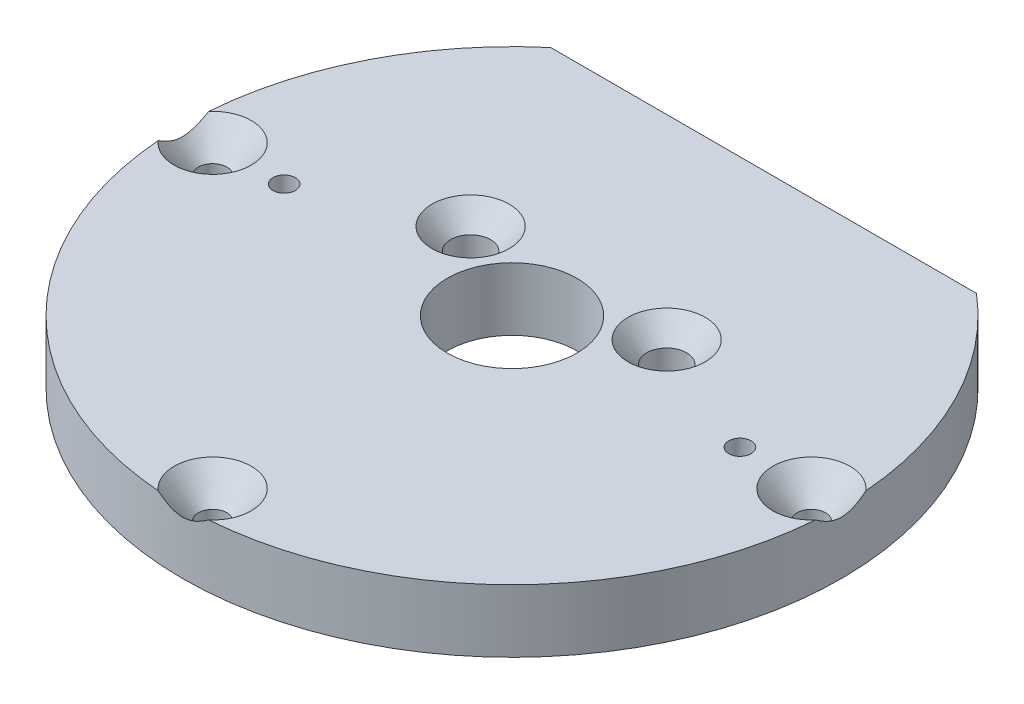
ISO-10303-21;
HEADER;
FILE_DESCRIPTION(('STEP AP214'),'2;1');
FILE_NAME('part.step','',(''),(''),'','','');
FILE_SCHEMA(('AUTOMOTIVE_DESIGN { 1 0 10303 214 1 1 1 1 }'));
ENDSEC;
DATA;
#1=APPLICATION_CONTEXT('core data for automotive mechanical design processes');
#2=APPLICATION_PROTOCOL_DEFINITION('international standard','automotive_design',2000,#1);
#3=PRODUCT_CONTEXT('',#1,'mechanical');
#4=PRODUCT('Part','Part','',(#3));
#5=PRODUCT_RELATED_PRODUCT_CATEGORY('part','',(#4));
#6=PRODUCT_DEFINITION_FORMATION('','',#4);
#7=PRODUCT_DEFINITION_CONTEXT('part definition',#1,'design');
#8=PRODUCT_DEFINITION('design','',#6,#7);
#9=PRODUCT_DEFINITION_SHAPE('','',#8);
#10=(LENGTH_UNIT() NAMED_UNIT(*) SI_UNIT(.MILLI.,.METRE.));
#11=(NAMED_UNIT(*) PLANE_ANGLE_UNIT() SI_UNIT($,.RADIAN.));
#12=(NAMED_UNIT(*) SI_UNIT($,.STERADIAN.) SOLID_ANGLE_UNIT());
#13=UNCERTAINTY_MEASURE_WITH_UNIT(LENGTH_MEASURE(1.E-05),#10,'distance_accuracy_value','');
#14=(GEOMETRIC_REPRESENTATION_CONTEXT(3) GLOBAL_UNCERTAINTY_ASSIGNED_CONTEXT((#13)) GLOBAL_UNIT_ASSIGNED_CONTEXT((#10,
#11,#12)) REPRESENTATION_CONTEXT('',''));
#15=CARTESIAN_POINT('',(0.,0.,0.));
#16=DIRECTION('',(0.,0.,1.));
#17=DIRECTION('',(1.,0.,0.));
#18=AXIS2_PLACEMENT_3D('',#15,#16,#17);
#19=CARTESIAN_POINT('',(0.,6.35,0.));
#20=DIRECTION('',(0.,-1.,0.));
#21=DIRECTION('',(0.,0.,-1.));
#22=AXIS2_PLACEMENT_3D('',#19,#20,#21);
#23=CYLINDRICAL_SURFACE('',#22,33.274);
#24=CARTESIAN_POINT('',(0.,6.35,0.));
#25=DIRECTION('',(0.,1.,0.));
#26=DIRECTION('',(0.,0.,1.));
#27=AXIS2_PLACEMENT_3D('',#24,#25,#26);
#28=CIRCLE('',#27,33.274);
#29=CARTESIAN_POINT('',(-21.4941637660087,6.35,-25.4));
#30=VERTEX_POINT('',#29);
#31=CARTESIAN_POINT('',(-33.1762180042017,6.35,-2.54904588771648));
#32=VERTEX_POINT('',#31);
#33=EDGE_CURVE('E68',#30,#32,#28,.T.);
#34=ORIENTED_EDGE('',*,*,#33,.F.);
#35=DIRECTION('',(0.,1.,0.));
#36=VECTOR('',#35,1.);
#37=CARTESIAN_POINT('',(-21.4941637660087,0.,-25.4));
#38=LINE('',#37,#36);
#39=CARTESIAN_POINT('',(-21.4941637660087,0.,-25.4));
#40=VERTEX_POINT('',#39);
#41=EDGE_CURVE('E94',#40,#30,#38,.T.);
#42=ORIENTED_EDGE('',*,*,#41,.F.);
#43=CARTESIAN_POINT('',(0.,0.,0.));
#44=DIRECTION('',(0.,1.,0.));
#45=DIRECTION('',(0.,0.,1.));
#46=AXIS2_PLACEMENT_3D('',#43,#44,#45);
#47=CIRCLE('',#46,33.274);
#48=CARTESIAN_POINT('',(21.4941637660087,0.,-25.4));
#49=VERTEX_POINT('',#48);
#50=EDGE_CURVE('E102',#40,#49,#47,.T.);
#51=ORIENTED_EDGE('',*,*,#50,.T.);
#52=DIRECTION('',(0.,1.,0.));
#53=VECTOR('',#52,1.);
#54=CARTESIAN_POINT('',(21.4941637660087,0.,-25.4));
#55=LINE('',#54,#53);
#56=CARTESIAN_POINT('',(21.4941637660087,6.35,-25.4));
#57=VERTEX_POINT('',#56);
#58=EDGE_CURVE('E60',#49,#57,#55,.T.);
#59=ORIENTED_EDGE('',*,*,#58,.T.);
#60=CARTESIAN_POINT('',(33.1762180042017,6.35,-2.5490458877165));
#61=VERTEX_POINT('',#60);
#62=EDGE_CURVE('E115',#61,#57,#28,.T.);
#63=ORIENTED_EDGE('',*,*,#62,.F.);
#64=CARTESIAN_POINT('',(33.1761955775648,6.3502,-2.54933775698086));
#65=CARTESIAN_POINT('',(33.1805825798049,6.31107939084975,-2.49224353407827));
#66=CARTESIAN_POINT('',(33.1848510304405,6.27250049597728,-2.43476969254307));
#67=CARTESIAN_POINT('',(33.1931441576657,6.19658644675497,-2.31897186656584));
#68=CARTESIAN_POINT('',(33.1971687808717,6.15925156556883,-2.26064769939652));
#69=CARTESIAN_POINT('',(33.2088943013344,6.04909511512583,-2.08384553223999));
#70=CARTESIAN_POINT('',(33.21621273273,5.97842751075451,-1.96397900073564));
#71=CARTESIAN_POINT('',(33.2299267423548,5.84287264009969,-1.71662751721354));
#72=CARTESIAN_POINT('',(33.2362915352426,5.77819684433707,-1.58902380768308));
#73=CARTESIAN_POINT('',(33.2477056933444,5.65973625813034,-1.32892352336059));
#74=CARTESIAN_POINT('',(33.252757166911,5.60593404296546,-1.19643518556831));
#75=CARTESIAN_POINT('',(33.2597607527403,5.53010959344534,-0.977000113714983));
#76=CARTESIAN_POINT('',(33.2621651774734,5.50373063278104,-0.891573911117783));
#77=CARTESIAN_POINT('',(33.2663443566313,5.45749882873885,-0.718930100382255));
#78=CARTESIAN_POINT('',(33.2681190973177,5.4376461277508,-0.63171245320232));
#79=CARTESIAN_POINT('',(33.2709765493234,5.40551094726472,-0.456890129599178));
#80=CARTESIAN_POINT('',(33.2720668907164,5.39314505771044,-0.369301096688982));
#81=CARTESIAN_POINT('',(33.2735544176201,5.3762413742042,-0.193361047117019));
#82=CARTESIAN_POINT('',(33.2739516632509,5.37170290129142,-0.105010097213181));
#83=CARTESIAN_POINT('',(33.2740401673081,5.37069333829633,0.0720342768338449));
#84=CARTESIAN_POINT('',(33.2737290643389,5.37424923209352,0.160727859594173));
#85=CARTESIAN_POINT('',(33.2724063706862,5.3892922728209,0.337431416023768));
#86=CARTESIAN_POINT('',(33.2713947189189,5.40078011136885,0.425441329404428));
#87=CARTESIAN_POINT('',(33.2686862677066,5.43128710485559,0.601168319089549));
#88=CARTESIAN_POINT('',(33.2669816807199,5.45039181327727,0.688870240584584));
#89=CARTESIAN_POINT('',(33.2629329615701,5.49527694915702,0.862503889061054));
#90=CARTESIAN_POINT('',(33.2605888461569,5.52105720177418,0.948435662341274));
#91=CARTESIAN_POINT('',(33.2536703765143,5.59615482408612,1.17109467674494));
#92=CARTESIAN_POINT('',(33.2486149947613,5.65014727225309,1.30623006374368));
#93=CARTESIAN_POINT('',(33.2371376661082,5.76954580051192,1.5714421316998));
#94=CARTESIAN_POINT('',(33.2307133355823,5.83497175250638,1.70150951482053));
#95=CARTESIAN_POINT('',(33.2168373397957,5.97236435376282,1.9535315600519));
#96=CARTESIAN_POINT('',(33.2094177537716,6.04410921552668,2.07561016696838));
#97=CARTESIAN_POINT('',(33.1975139212334,6.15604068896211,2.25560127653234));
#98=CARTESIAN_POINT('',(33.1934262548253,6.19398636529059,2.3149562707655));
#99=CARTESIAN_POINT('',(33.1849984365551,6.27116810514676,2.43278419120686));
#100=CARTESIAN_POINT('',(33.1806583435334,6.31040386703801,2.49125731900659));
#101=CARTESIAN_POINT('',(33.1761955775648,6.3502,2.54933775698086));
#102=B_SPLINE_CURVE_WITH_KNOTS('',3,(#64,#65,#66,#67,#68,#69,#70,#71,#72,#73,#74,#75,#76,#77,
#78,#79,#80,#81,#82,#83,#84,#85,#86,#87,#88,#89,#90,#91,#92,#93,#94,#95,#96,#97,#98,#99,#100,
#101),.UNSPECIFIED.,.F.,.F.,(4,2,2,2,2,2,2,2,2,2,2,2,2,2,2,2,2,2,4),(0.,0.208043349461832,
0.4161320845316,0.833921512402193,1.26315987875747,1.69170484689115,1.95980491509329,
2.22791083231083,2.49297203327847,2.75801024131868,3.02393329047977,3.28987952945598,
3.55890108157153,3.82791558838638,4.26397379238092,4.70079756122368,5.12593596847389,
5.33762144708327,5.54925777837407),.UNSPECIFIED.);
#103=CARTESIAN_POINT('',(33.1762180042017,6.35,2.54904588771648));
#104=VERTEX_POINT('',#103);
#105=EDGE_CURVE('E122',#61,#104,#102,.T.);
#106=ORIENTED_EDGE('',*,*,#105,.T.);
#107=CARTESIAN_POINT('',(2.5490458877165,6.35,33.1762180042017));
#108=VERTEX_POINT('',#107);
#109=EDGE_CURVE('E107',#108,#104,#28,.T.);
#110=ORIENTED_EDGE('',*,*,#109,.F.);
#111=CARTESIAN_POINT('',(2.54933775698085,6.3502,33.1761955775648));
#112=CARTESIAN_POINT('',(2.49224353407827,6.31107939084975,33.1805825798049));
#113=CARTESIAN_POINT('',(2.43476969254307,6.27250049597728,33.1848510304405));
#114=CARTESIAN_POINT('',(2.31897186656584,6.19658644675497,33.1931441576657));
#115=CARTESIAN_POINT('',(2.26064769939652,6.15925156556883,33.1971687808717));
#116=CARTESIAN_POINT('',(2.08384553223999,6.04909511512584,33.2088943013344));
#117=CARTESIAN_POINT('',(1.96397900073564,5.97842751075451,33.21621273273));
#118=CARTESIAN_POINT('',(1.71662751721354,5.84287264009969,33.2299267423548));
#119=CARTESIAN_POINT('',(1.58902380768308,5.77819684433707,33.2362915352426));
#120=CARTESIAN_POINT('',(1.32892352336059,5.65973625813034,33.2477056933444));
#121=CARTESIAN_POINT('',(1.19643518556831,5.60593404296546,33.252757166911));
#122=CARTESIAN_POINT('',(0.977000113714983,5.53010959344534,33.2597607527403));
#123=CARTESIAN_POINT('',(0.891573911117783,5.50373063278104,33.2621651774734));
#124=CARTESIAN_POINT('',(0.718930100382255,5.45749882873885,33.2663443566313));
#125=CARTESIAN_POINT('',(0.63171245320232,5.4376461277508,33.2681190973177));
#126=CARTESIAN_POINT('',(0.456890129599178,5.40551094726472,33.2709765493234));
#127=CARTESIAN_POINT('',(0.369301096688982,5.39314505771044,33.2720668907164));
#128=CARTESIAN_POINT('',(0.193361047117019,5.3762413742042,33.2735544176201));
#129=CARTESIAN_POINT('',(0.105010097213181,5.37170290129142,33.2739516632509));
#130=CARTESIAN_POINT('',(-0.0720342768338451,5.37069333829633,33.2740401673081));
#131=CARTESIAN_POINT('',(-0.160727859594173,5.37424923209352,33.2737290643389));
#132=CARTESIAN_POINT('',(-0.337431416023768,5.3892922728209,33.2724063706862));
#133=CARTESIAN_POINT('',(-0.425441329404428,5.40078011136885,33.2713947189189));
#134=CARTESIAN_POINT('',(-0.601168319089549,5.43128710485559,33.2686862677066));
#135=CARTESIAN_POINT('',(-0.688870240584584,5.45039181327727,33.2669816807199));
#136=CARTESIAN_POINT('',(-0.862503889061054,5.49527694915702,33.2629329615701));
#137=CARTESIAN_POINT('',(-0.948435662341275,5.52105720177418,33.2605888461569));
#138=CARTESIAN_POINT('',(-1.17109467674494,5.59615482408612,33.2536703765143));
#139=CARTESIAN_POINT('',(-1.30623006374369,5.65014727225309,33.2486149947613));
#140=CARTESIAN_POINT('',(-1.5714421316998,5.76954580051192,33.2371376661082));
#141=CARTESIAN_POINT('',(-1.70150951482053,5.83497175250638,33.2307133355823));
#142=CARTESIAN_POINT('',(-1.9535315600519,5.97236435376283,33.2168373397957));
#143=CARTESIAN_POINT('',(-2.07561016696838,6.04410921552668,33.2094177537716));
#144=CARTESIAN_POINT('',(-2.25560127653234,6.15604068896211,33.1975139212334));
#145=CARTESIAN_POINT('',(-2.3149562707655,6.19398636529059,33.1934262548253));
#146=CARTESIAN_POINT('',(-2.43278419120686,6.27116810514676,33.1849984365551));
#147=CARTESIAN_POINT('',(-2.49125731900659,6.31040386703801,33.1806583435334));
#148=CARTESIAN_POINT('',(-2.54933775698085,6.3502,33.1761955775648));
#149=B_SPLINE_CURVE_WITH_KNOTS('',3,(#111,#112,#113,#114,#115,#116,#117,#118,#119,#120,#121,
#122,#123,#124,#125,#126,#127,#128,#129,#130,#131,#132,#133,#134,#135,#136,#137,#138,#139,#140,
#141,#142,#143,#144,#145,#146,#147,#148),.UNSPECIFIED.,.F.,.F.,(4,2,2,2,2,2,2,2,2,2,2,2,2,2,2,2,
2,2,4),(0.,0.208043349461831,0.416132084531598,0.833921512402193,1.26315987875747,
1.69170484689115,1.95980491509329,2.22791083231083,2.49297203327847,2.75801024131868,
3.02393329047977,3.28987952945598,3.55890108157153,3.82791558838638,4.26397379238092,
4.70079756122368,5.12593596847389,5.33762144708327,5.54925777837407),.UNSPECIFIED.);
#150=CARTESIAN_POINT('',(-2.54904588771647,6.35,33.1762180042017));
#151=VERTEX_POINT('',#150);
#152=EDGE_CURVE('E53',#108,#151,#149,.T.);
#153=ORIENTED_EDGE('',*,*,#152,.T.);
#154=CARTESIAN_POINT('',(-33.1762180042017,6.35,2.5490458877165));
#155=VERTEX_POINT('',#154);
#156=EDGE_CURVE('E113',#155,#151,#28,.T.);
#157=ORIENTED_EDGE('',*,*,#156,.F.);
#158=CARTESIAN_POINT('',(-33.1761955775648,6.3502,2.54933775698086));
#159=CARTESIAN_POINT('',(-33.1805825798049,6.31107939084975,2.49224353407827));
#160=CARTESIAN_POINT('',(-33.1848510304405,6.27250049597728,2.43476969254307));
#161=CARTESIAN_POINT('',(-33.1931441576657,6.19658644675497,2.31897186656584));
#162=CARTESIAN_POINT('',(-33.1971687808717,6.15925156556883,2.26064769939652));
#163=CARTESIAN_POINT('',(-33.2088943013344,6.04909511512583,2.08384553223999));
#164=CARTESIAN_POINT('',(-33.21621273273,5.97842751075451,1.96397900073564));
#165=CARTESIAN_POINT('',(-33.2299267423548,5.84287264009969,1.71662751721354));
#166=CARTESIAN_POINT('',(-33.2362915352426,5.77819684433707,1.58902380768308));
#167=CARTESIAN_POINT('',(-33.2477056933444,5.65973625813034,1.32892352336059));
#168=CARTESIAN_POINT('',(-33.252757166911,5.60593404296546,1.19643518556831));
#169=CARTESIAN_POINT('',(-33.2597607527403,5.53010959344534,0.977000113714983));
#170=CARTESIAN_POINT('',(-33.2621651774734,5.50373063278104,0.891573911117783));
#171=CARTESIAN_POINT('',(-33.2663443566313,5.45749882873885,0.718930100382255));
#172=CARTESIAN_POINT('',(-33.2681190973177,5.4376461277508,0.63171245320232));
#173=CARTESIAN_POINT('',(-33.2709765493234,5.40551094726472,0.456890129599178));
#174=CARTESIAN_POINT('',(-33.2720668907164,5.39314505771044,0.369301096688982));
#175=CARTESIAN_POINT('',(-33.2735544176201,5.3762413742042,0.193361047117019));
#176=CARTESIAN_POINT('',(-33.2739516632509,5.37170290129142,0.105010097213181));
#177=CARTESIAN_POINT('',(-33.2740401673081,5.37069333829633,-0.0720342768338449));
#178=CARTESIAN_POINT('',(-33.2737290643389,5.37424923209352,-0.160727859594173));
#179=CARTESIAN_POINT('',(-33.2724063706862,5.3892922728209,-0.337431416023768));
#180=CARTESIAN_POINT('',(-33.2713947189189,5.40078011136885,-0.425441329404428));
#181=CARTESIAN_POINT('',(-33.2686862677066,5.43128710485559,-0.601168319089549));
#182=CARTESIAN_POINT('',(-33.2669816807199,5.45039181327727,-0.688870240584584));
#183=CARTESIAN_POINT('',(-33.2629329615701,5.49527694915702,-0.862503889061054));
#184=CARTESIAN_POINT('',(-33.2605888461569,5.52105720177418,-0.948435662341274));
#185=CARTESIAN_POINT('',(-33.2536703765143,5.59615482408612,-1.17109467674494));
#186=CARTESIAN_POINT('',(-33.2486149947613,5.65014727225309,-1.30623006374368));
#187=CARTESIAN_POINT('',(-33.2371376661082,5.76954580051192,-1.5714421316998));
#188=CARTESIAN_POINT('',(-33.2307133355823,5.83497175250638,-1.70150951482053));
#189=CARTESIAN_POINT('',(-33.2168373397957,5.97236435376282,-1.9535315600519));
#190=CARTESIAN_POINT('',(-33.2094177537716,6.04410921552668,-2.07561016696838));
#191=CARTESIAN_POINT('',(-33.1975139212334,6.15604068896211,-2.25560127653234));
#192=CARTESIAN_POINT('',(-33.1934262548253,6.19398636529059,-2.3149562707655));
#193=CARTESIAN_POINT('',(-33.1849984365551,6.27116810514676,-2.43278419120686));
#194=CARTESIAN_POINT('',(-33.1806583435334,6.31040386703801,-2.49125731900659));
#195=CARTESIAN_POINT('',(-33.1761955775648,6.3502,-2.54933775698086));
#196=B_SPLINE_CURVE_WITH_KNOTS('',3,(#158,#159,#160,#161,#162,#163,#164,#165,#166,#167,#168,
#169,#170,#171,#172,#173,#174,#175,#176,#177,#178,#179,#180,#181,#182,#183,#184,#185,#186,#187,
#188,#189,#190,#191,#192,#193,#194,#195),.UNSPECIFIED.,.F.,.F.,(4,2,2,2,2,2,2,2,2,2,2,2,2,2,2,2,
2,2,4),(0.,0.208043349461832,0.4161320845316,0.833921512402193,1.26315987875747,
1.69170484689115,1.95980491509329,2.22791083231083,2.49297203327847,2.75801024131868,
3.02393329047977,3.28987952945598,3.55890108157153,3.82791558838638,4.26397379238092,
4.70079756122368,5.12593596847389,5.33762144708327,5.54925777837407),.UNSPECIFIED.);
#197=EDGE_CURVE('E12',#155,#32,#196,.T.);
#198=ORIENTED_EDGE('',*,*,#197,.T.);
#199=EDGE_LOOP('',(#34,#42,#51,#59,#63,#106,#110,#153,#157,#198));
#200=FACE_BOUND('',#199,.T.);
#201=ADVANCED_FACE('F43',(#200),#23,.T.);
#202=CARTESIAN_POINT('',(0.,6.35,0.));
#203=DIRECTION('',(0.,1.,0.));
#204=DIRECTION('',(0.,0.,1.));
#205=AXIS2_PLACEMENT_3D('',#202,#203,#204);
#206=PLANE('',#205);
#207=DIRECTION('',(1.,0.,0.));
#208=VECTOR('',#207,1.);
#209=CARTESIAN_POINT('',(0.,6.35,-25.4));
#210=LINE('',#209,#208);
#211=EDGE_CURVE('E99',#30,#57,#210,.T.);
#212=ORIENTED_EDGE('',*,*,#211,.F.);
#213=ORIENTED_EDGE('',*,*,#33,.T.);
#214=CARTESIAN_POINT('',(-30.226,6.35,0.));
#215=DIRECTION('',(0.,1.,0.));
#216=DIRECTION('',(0.,0.,1.));
#217=AXIS2_PLACEMENT_3D('',#214,#215,#216);
#218=CIRCLE('',#217,3.8989);
#219=EDGE_CURVE('E516',#155,#32,#218,.T.);
#220=ORIENTED_EDGE('',*,*,#219,.F.);
#221=ORIENTED_EDGE('',*,*,#156,.T.);
#222=CARTESIAN_POINT('',(0.,6.35,30.226));
#223=DIRECTION('',(0.,1.,0.));
#224=DIRECTION('',(0.,0.,1.));
#225=AXIS2_PLACEMENT_3D('',#222,#223,#224);
#226=CIRCLE('',#225,3.8989);
#227=EDGE_CURVE('E417',#108,#151,#226,.T.);
#228=ORIENTED_EDGE('',*,*,#227,.F.);
#229=ORIENTED_EDGE('',*,*,#109,.T.);
#230=CARTESIAN_POINT('',(30.226,6.35,0.));
#231=DIRECTION('',(0.,1.,0.));
#232=DIRECTION('',(0.,0.,1.));
#233=AXIS2_PLACEMENT_3D('',#230,#231,#232);
#234=CIRCLE('',#233,3.8989);
#235=EDGE_CURVE('E410',#61,#104,#234,.T.);
#236=ORIENTED_EDGE('',*,*,#235,.F.);
#237=ORIENTED_EDGE('',*,*,#62,.T.);
#238=EDGE_LOOP('',(#212,#213,#220,#221,#228,#229,#236,#237));
#239=FACE_BOUND('',#238,.T.);
#240=CARTESIAN_POINT('',(-9.89867036525613,6.35,-5.71500000000001));
#241=DIRECTION('',(0.,1.,0.));
#242=DIRECTION('',(0.,0.,1.));
#243=AXIS2_PLACEMENT_3D('',#240,#241,#242);
#244=CIRCLE('',#243,3.8989);
#245=CARTESIAN_POINT('',(-9.89867036525613,6.35,-1.81610000000001));
#246=VERTEX_POINT('',#245);
#247=EDGE_CURVE('E469',#246,#246,#244,.T.);
#248=ORIENTED_EDGE('',*,*,#247,.F.);
#249=EDGE_LOOP('',(#248));
#250=FACE_BOUND('',#249,.T.);
#251=CARTESIAN_POINT('',(9.89867036525612,6.35,-5.71500000000001));
#252=DIRECTION('',(0.,1.,0.));
#253=DIRECTION('',(0.,0.,1.));
#254=AXIS2_PLACEMENT_3D('',#251,#252,#253);
#255=CIRCLE('',#254,3.8989);
#256=CARTESIAN_POINT('',(9.89867036525612,6.35,-1.81610000000001));
#257=VERTEX_POINT('',#256);
#258=EDGE_CURVE('E481',#257,#257,#255,.T.);
#259=ORIENTED_EDGE('',*,*,#258,.F.);
#260=EDGE_LOOP('',(#259));
#261=FACE_BOUND('',#260,.T.);
#262=CARTESIAN_POINT('',(0.,6.35,0.));
#263=DIRECTION('',(0.,1.,0.));
#264=DIRECTION('',(0.,0.,1.));
#265=AXIS2_PLACEMENT_3D('',#262,#263,#264);
#266=CIRCLE('',#265,6.54812);
#267=CARTESIAN_POINT('',(0.,6.35,6.54812));
#268=VERTEX_POINT('',#267);
#269=EDGE_CURVE('E493',#268,#268,#266,.T.);
#270=ORIENTED_EDGE('',*,*,#269,.F.);
#271=EDGE_LOOP('',(#270));
#272=FACE_BOUND('',#271,.T.);
#273=CARTESIAN_POINT('',(23.0124,6.35,0.));
#274=DIRECTION('',(0.,1.,0.));
#275=DIRECTION('',(0.,0.,1.));
#276=AXIS2_PLACEMENT_3D('',#273,#274,#275);
#277=CIRCLE('',#276,1.13029999999999);
#278=CARTESIAN_POINT('',(23.0124,6.35,1.13029999999999));
#279=VERTEX_POINT('',#278);
#280=EDGE_CURVE('E501',#279,#279,#277,.T.);
#281=ORIENTED_EDGE('',*,*,#280,.F.);
#282=EDGE_LOOP('',(#281));
#283=FACE_BOUND('',#282,.T.);
#284=CARTESIAN_POINT('',(-23.0124,6.35,0.));
#285=DIRECTION('',(0.,1.,0.));
#286=DIRECTION('',(0.,0.,1.));
#287=AXIS2_PLACEMENT_3D('',#284,#285,#286);
#288=CIRCLE('',#287,1.13029999999999);
#289=CARTESIAN_POINT('',(-23.0124,6.35,1.13029999999999));
#290=VERTEX_POINT('',#289);
#291=EDGE_CURVE('E509',#290,#290,#288,.T.);
#292=ORIENTED_EDGE('',*,*,#291,.F.);
#293=EDGE_LOOP('',(#292));
#294=FACE_BOUND('',#293,.T.);
#295=ADVANCED_FACE('F143',(#239,#250,#261,#272,#283,#294),#206,.T.);
#296=CARTESIAN_POINT('',(0.,0.,0.));
#297=DIRECTION('',(0.,1.,0.));
#298=DIRECTION('',(0.,0.,1.));
#299=AXIS2_PLACEMENT_3D('',#296,#297,#298);
#300=PLANE('',#299);
#301=CARTESIAN_POINT('',(-9.89867036525613,0.,-5.71500000000001));
#302=DIRECTION('',(0.,1.,0.));
#303=DIRECTION('',(0.,0.,1.));
#304=AXIS2_PLACEMENT_3D('',#301,#302,#303);
#305=CIRCLE('',#304,2.01929999999999);
#306=CARTESIAN_POINT('',(-9.89867036525613,0.,-3.69570000000002));
#307=VERTEX_POINT('',#306);
#308=EDGE_CURVE('E478',#307,#307,#305,.T.);
#309=ORIENTED_EDGE('',*,*,#308,.T.);
#310=EDGE_LOOP('',(#309));
#311=FACE_BOUND('',#310,.T.);
#312=CARTESIAN_POINT('',(9.89867036525612,0.,-5.71500000000001));
#313=DIRECTION('',(0.,1.,0.));
#314=DIRECTION('',(0.,0.,1.));
#315=AXIS2_PLACEMENT_3D('',#312,#313,#314);
#316=CIRCLE('',#315,2.01929999999999);
#317=CARTESIAN_POINT('',(9.89867036525612,0.,-3.69570000000003));
#318=VERTEX_POINT('',#317);
#319=EDGE_CURVE('E489',#318,#318,#316,.T.);
#320=ORIENTED_EDGE('',*,*,#319,.T.);
#321=EDGE_LOOP('',(#320));
#322=FACE_BOUND('',#321,.T.);
#323=CARTESIAN_POINT('',(0.,0.,0.));
#324=DIRECTION('',(0.,1.,0.));
#325=DIRECTION('',(0.,0.,1.));
#326=AXIS2_PLACEMENT_3D('',#323,#324,#325);
#327=CIRCLE('',#326,6.54812);
#328=CARTESIAN_POINT('',(0.,0.,6.54812));
#329=VERTEX_POINT('',#328);
#330=EDGE_CURVE('E497',#329,#329,#327,.T.);
#331=ORIENTED_EDGE('',*,*,#330,.T.);
#332=EDGE_LOOP('',(#331));
#333=FACE_BOUND('',#332,.T.);
#334=CARTESIAN_POINT('',(23.0124,0.,0.));
#335=DIRECTION('',(0.,1.,0.));
#336=DIRECTION('',(0.,0.,1.));
#337=AXIS2_PLACEMENT_3D('',#334,#335,#336);
#338=CIRCLE('',#337,1.1303);
#339=CARTESIAN_POINT('',(23.0124,0.,1.1303));
#340=VERTEX_POINT('',#339);
#341=EDGE_CURVE('E505',#340,#340,#338,.T.);
#342=ORIENTED_EDGE('',*,*,#341,.T.);
#343=EDGE_LOOP('',(#342));
#344=FACE_BOUND('',#343,.T.);
#345=CARTESIAN_POINT('',(-23.0124,0.,0.));
#346=DIRECTION('',(0.,1.,0.));
#347=DIRECTION('',(0.,0.,1.));
#348=AXIS2_PLACEMENT_3D('',#345,#346,#347);
#349=CIRCLE('',#348,1.1303);
#350=CARTESIAN_POINT('',(-23.0124,0.,1.1303));
#351=VERTEX_POINT('',#350);
#352=EDGE_CURVE('E513',#351,#351,#349,.T.);
#353=ORIENTED_EDGE('',*,*,#352,.T.);
#354=EDGE_LOOP('',(#353));
#355=FACE_BOUND('',#354,.T.);
#356=CARTESIAN_POINT('',(-30.226,0.,0.));
#357=DIRECTION('',(0.,1.,0.));
#358=DIRECTION('',(0.,0.,1.));
#359=AXIS2_PLACEMENT_3D('',#356,#357,#358);
#360=CIRCLE('',#359,1.43509999999999);
#361=CARTESIAN_POINT('',(-30.226,0.,1.43509999999999));
#362=VERTEX_POINT('',#361);
#363=EDGE_CURVE('E47',#362,#362,#360,.T.);
#364=ORIENTED_EDGE('',*,*,#363,.T.);
#365=EDGE_LOOP('',(#364));
#366=FACE_BOUND('',#365,.T.);
#367=CARTESIAN_POINT('',(0.,0.,30.226));
#368=DIRECTION('',(0.,1.,0.));
#369=DIRECTION('',(0.,0.,1.));
#370=AXIS2_PLACEMENT_3D('',#367,#368,#369);
#371=CIRCLE('',#370,1.43509999999999);
#372=CARTESIAN_POINT('',(0.,0.,31.6611));
#373=VERTEX_POINT('',#372);
#374=EDGE_CURVE('E407',#373,#373,#371,.T.);
#375=ORIENTED_EDGE('',*,*,#374,.T.);
#376=EDGE_LOOP('',(#375));
#377=FACE_BOUND('',#376,.T.);
#378=CARTESIAN_POINT('',(30.226,0.,0.));
#379=DIRECTION('',(0.,1.,0.));
#380=DIRECTION('',(0.,0.,1.));
#381=AXIS2_PLACEMENT_3D('',#378,#379,#380);
#382=CIRCLE('',#381,1.43509999999999);
#383=CARTESIAN_POINT('',(30.226,0.,1.43509999999999));
#384=VERTEX_POINT('',#383);
#385=EDGE_CURVE('E108',#384,#384,#382,.T.);
#386=ORIENTED_EDGE('',*,*,#385,.T.);
#387=EDGE_LOOP('',(#386));
#388=FACE_BOUND('',#387,.T.);
#389=ORIENTED_EDGE('',*,*,#50,.F.);
#390=DIRECTION('',(1.,0.,0.));
#391=VECTOR('',#390,1.);
#392=CARTESIAN_POINT('',(0.,0.,-25.4));
#393=LINE('',#392,#391);
#394=EDGE_CURVE('E91',#40,#49,#393,.T.);
#395=ORIENTED_EDGE('',*,*,#394,.T.);
#396=EDGE_LOOP('',(#389,#395));
#397=FACE_BOUND('',#396,.T.);
#398=ADVANCED_FACE('F105',(#311,#322,#333,#344,#355,#366,#377,#388,#397),#300,.F.);
#399=CARTESIAN_POINT('',(30.226,6.35,0.));
#400=DIRECTION('',(0.,1.,0.));
#401=DIRECTION('',(0.,0.,1.));
#402=AXIS2_PLACEMENT_3D('',#399,#400,#401);
#403=CYLINDRICAL_SURFACE('',#402,1.43509999999999);
#404=CARTESIAN_POINT('',(30.226,3.51572231828887,0.));
#405=DIRECTION('',(0.,1.,0.));
#406=DIRECTION('',(0.,0.,1.));
#407=AXIS2_PLACEMENT_3D('',#404,#405,#406);
#408=CIRCLE('',#407,1.4351);
#409=CARTESIAN_POINT('',(30.226,3.51572231828887,1.4351));
#410=VERTEX_POINT('',#409);
#411=EDGE_CURVE('E118',#410,#410,#408,.T.);
#412=ORIENTED_EDGE('',*,*,#411,.T.);
#413=EDGE_LOOP('',(#412));
#414=FACE_BOUND('',#413,.T.);
#415=ORIENTED_EDGE('',*,*,#385,.F.);
#416=EDGE_LOOP('',(#415));
#417=FACE_BOUND('',#416,.T.);
#418=ADVANCED_FACE('F137',(#414,#417),#403,.F.);
#419=CARTESIAN_POINT('',(30.226,6.35,0.));
#420=DIRECTION('',(0.,1.,0.));
#421=DIRECTION('',(0.,0.,1.));
#422=AXIS2_PLACEMENT_3D('',#419,#420,#421);
#423=CONICAL_SURFACE('',#422,3.8989,0.715584993317675);
#424=ORIENTED_EDGE('',*,*,#411,.F.);
#425=EDGE_LOOP('',(#424));
#426=FACE_BOUND('',#425,.T.);
#427=ORIENTED_EDGE('',*,*,#235,.T.);
#428=ORIENTED_EDGE('',*,*,#105,.F.);
#429=EDGE_LOOP('',(#427,#428));
#430=FACE_BOUND('',#429,.T.);
#431=ADVANCED_FACE('F131',(#426,#430),#423,.F.);
#432=CARTESIAN_POINT('',(0.,6.35,30.226));
#433=DIRECTION('',(0.,1.,0.));
#434=DIRECTION('',(0.,0.,1.));
#435=AXIS2_PLACEMENT_3D('',#432,#433,#434);
#436=CYLINDRICAL_SURFACE('',#435,1.43509999999999);
#437=CARTESIAN_POINT('',(0.,3.51572231828887,30.226));
#438=DIRECTION('',(0.,1.,0.));
#439=DIRECTION('',(0.,0.,1.));
#440=AXIS2_PLACEMENT_3D('',#437,#438,#439);
#441=CIRCLE('',#440,1.4351);
#442=CARTESIAN_POINT('',(0.,3.51572231828887,31.6611));
#443=VERTEX_POINT('',#442);
#444=EDGE_CURVE('E404',#443,#443,#441,.T.);
#445=ORIENTED_EDGE('',*,*,#444,.T.);
#446=EDGE_LOOP('',(#445));
#447=FACE_BOUND('',#446,.T.);
#448=ORIENTED_EDGE('',*,*,#374,.F.);
#449=EDGE_LOOP('',(#448));
#450=FACE_BOUND('',#449,.T.);
#451=ADVANCED_FACE('F136',(#447,#450),#436,.F.);
#452=CARTESIAN_POINT('',(0.,6.35,30.226));
#453=DIRECTION('',(0.,1.,0.));
#454=DIRECTION('',(0.,0.,1.));
#455=AXIS2_PLACEMENT_3D('',#452,#453,#454);
#456=CONICAL_SURFACE('',#455,3.8989,0.715584993317675);
#457=ORIENTED_EDGE('',*,*,#444,.F.);
#458=EDGE_LOOP('',(#457));
#459=FACE_BOUND('',#458,.T.);
#460=ORIENTED_EDGE('',*,*,#227,.T.);
#461=ORIENTED_EDGE('',*,*,#152,.F.);
#462=EDGE_LOOP('',(#460,#461));
#463=FACE_BOUND('',#462,.T.);
#464=ADVANCED_FACE('F177',(#459,#463),#456,.F.);
#465=CARTESIAN_POINT('',(-30.226,6.35,0.));
#466=DIRECTION('',(0.,1.,0.));
#467=DIRECTION('',(0.,0.,1.));
#468=AXIS2_PLACEMENT_3D('',#465,#466,#467);
#469=CYLINDRICAL_SURFACE('',#468,1.43509999999999);
#470=CARTESIAN_POINT('',(-30.226,3.51572231828887,0.));
#471=DIRECTION('',(0.,1.,0.));
#472=DIRECTION('',(0.,0.,1.));
#473=AXIS2_PLACEMENT_3D('',#470,#471,#472);
#474=CIRCLE('',#473,1.4351);
#475=CARTESIAN_POINT('',(-30.226,3.51572231828887,1.4351));
#476=VERTEX_POINT('',#475);
#477=EDGE_CURVE('E445',#476,#476,#474,.T.);
#478=ORIENTED_EDGE('',*,*,#477,.T.);
#479=EDGE_LOOP('',(#478));
#480=FACE_BOUND('',#479,.T.);
#481=ORIENTED_EDGE('',*,*,#363,.F.);
#482=EDGE_LOOP('',(#481));
#483=FACE_BOUND('',#482,.T.);
#484=ADVANCED_FACE('F181',(#480,#483),#469,.F.);
#485=CARTESIAN_POINT('',(-30.226,6.35,0.));
#486=DIRECTION('',(0.,1.,0.));
#487=DIRECTION('',(0.,0.,1.));
#488=AXIS2_PLACEMENT_3D('',#485,#486,#487);
#489=CONICAL_SURFACE('',#488,3.8989,0.715584993317675);
#490=ORIENTED_EDGE('',*,*,#477,.F.);
#491=EDGE_LOOP('',(#490));
#492=FACE_BOUND('',#491,.T.);
#493=ORIENTED_EDGE('',*,*,#219,.T.);
#494=ORIENTED_EDGE('',*,*,#197,.F.);
#495=EDGE_LOOP('',(#493,#494));
#496=FACE_BOUND('',#495,.T.);
#497=ADVANCED_FACE('F188',(#492,#496),#489,.F.);
#498=CARTESIAN_POINT('',(-23.0124,6.35,0.));
#499=DIRECTION('',(0.,1.,0.));
#500=DIRECTION('',(0.,0.,1.));
#501=AXIS2_PLACEMENT_3D('',#498,#499,#500);
#502=CYLINDRICAL_SURFACE('',#501,1.13029999999999);
#503=ORIENTED_EDGE('',*,*,#352,.F.);
#504=EDGE_LOOP('',(#503));
#505=FACE_BOUND('',#504,.T.);
#506=ORIENTED_EDGE('',*,*,#291,.T.);
#507=EDGE_LOOP('',(#506));
#508=FACE_BOUND('',#507,.T.);
#509=ADVANCED_FACE('F192',(#505,#508),#502,.F.);
#510=CARTESIAN_POINT('',(23.0124,6.35,0.));
#511=DIRECTION('',(0.,1.,0.));
#512=DIRECTION('',(0.,0.,1.));
#513=AXIS2_PLACEMENT_3D('',#510,#511,#512);
#514=CYLINDRICAL_SURFACE('',#513,1.13029999999999);
#515=ORIENTED_EDGE('',*,*,#341,.F.);
#516=EDGE_LOOP('',(#515));
#517=FACE_BOUND('',#516,.T.);
#518=ORIENTED_EDGE('',*,*,#280,.T.);
#519=EDGE_LOOP('',(#518));
#520=FACE_BOUND('',#519,.T.);
#521=ADVANCED_FACE('F203',(#517,#520),#514,.F.);
#522=CARTESIAN_POINT('',(0.,6.35,0.));
#523=DIRECTION('',(0.,1.,0.));
#524=DIRECTION('',(0.,0.,1.));
#525=AXIS2_PLACEMENT_3D('',#522,#523,#524);
#526=CYLINDRICAL_SURFACE('',#525,6.54812);
#527=ORIENTED_EDGE('',*,*,#330,.F.);
#528=EDGE_LOOP('',(#527));
#529=FACE_BOUND('',#528,.T.);
#530=ORIENTED_EDGE('',*,*,#269,.T.);
#531=EDGE_LOOP('',(#530));
#532=FACE_BOUND('',#531,.T.);
#533=ADVANCED_FACE('F213',(#529,#532),#526,.F.);
#534=CARTESIAN_POINT('',(9.89867036525612,6.35,-5.71500000000001));
#535=DIRECTION('',(0.,1.,0.));
#536=DIRECTION('',(0.,0.,1.));
#537=AXIS2_PLACEMENT_3D('',#534,#535,#536);
#538=CYLINDRICAL_SURFACE('',#537,2.01929999999999);
#539=ORIENTED_EDGE('',*,*,#319,.F.);
#540=EDGE_LOOP('',(#539));
#541=FACE_BOUND('',#540,.T.);
#542=CARTESIAN_POINT('',(9.89867036525612,4.18776754178739,-5.71500000000001));
#543=DIRECTION('',(0.,1.,0.));
#544=DIRECTION('',(0.,0.,1.));
#545=AXIS2_PLACEMENT_3D('',#542,#543,#544);
#546=CIRCLE('',#545,2.0193);
#547=CARTESIAN_POINT('',(9.89867036525612,4.18776754178739,-3.69570000000001));
#548=VERTEX_POINT('',#547);
#549=EDGE_CURVE('E485',#548,#548,#546,.T.);
#550=ORIENTED_EDGE('',*,*,#549,.T.);
#551=EDGE_LOOP('',(#550));
#552=FACE_BOUND('',#551,.T.);
#553=ADVANCED_FACE('F224',(#541,#552),#538,.F.);
#554=CARTESIAN_POINT('',(9.89867036525612,6.35,-5.71500000000001));
#555=DIRECTION('',(0.,1.,0.));
#556=DIRECTION('',(0.,0.,1.));
#557=AXIS2_PLACEMENT_3D('',#554,#555,#556);
#558=CONICAL_SURFACE('',#557,3.8989,0.715584993317675);
#559=ORIENTED_EDGE('',*,*,#549,.F.);
#560=EDGE_LOOP('',(#559));
#561=FACE_BOUND('',#560,.T.);
#562=ORIENTED_EDGE('',*,*,#258,.T.);
#563=EDGE_LOOP('',(#562));
#564=FACE_BOUND('',#563,.T.);
#565=ADVANCED_FACE('F264',(#561,#564),#558,.F.);
#566=CARTESIAN_POINT('',(-9.89867036525613,6.35,-5.71500000000001));
#567=DIRECTION('',(0.,1.,0.));
#568=DIRECTION('',(0.,0.,1.));
#569=AXIS2_PLACEMENT_3D('',#566,#567,#568);
#570=CYLINDRICAL_SURFACE('',#569,2.01929999999999);
#571=ORIENTED_EDGE('',*,*,#308,.F.);
#572=EDGE_LOOP('',(#571));
#573=FACE_BOUND('',#572,.T.);
#574=CARTESIAN_POINT('',(-9.89867036525613,4.18776754178739,-5.71500000000001));
#575=DIRECTION('',(0.,1.,0.));
#576=DIRECTION('',(0.,0.,1.));
#577=AXIS2_PLACEMENT_3D('',#574,#575,#576);
#578=CIRCLE('',#577,2.0193);
#579=CARTESIAN_POINT('',(-9.89867036525613,4.18776754178739,-3.69570000000001));
#580=VERTEX_POINT('',#579);
#581=EDGE_CURVE('E474',#580,#580,#578,.T.);
#582=ORIENTED_EDGE('',*,*,#581,.T.);
#583=EDGE_LOOP('',(#582));
#584=FACE_BOUND('',#583,.T.);
#585=ADVANCED_FACE('F252',(#573,#584),#570,.F.);
#586=CARTESIAN_POINT('',(-9.89867036525613,6.35,-5.71500000000001));
#587=DIRECTION('',(0.,1.,0.));
#588=DIRECTION('',(0.,0.,1.));
#589=AXIS2_PLACEMENT_3D('',#586,#587,#588);
#590=CONICAL_SURFACE('',#589,3.8989,0.715584993317675);
#591=ORIENTED_EDGE('',*,*,#581,.F.);
#592=EDGE_LOOP('',(#591));
#593=FACE_BOUND('',#592,.T.);
#594=ORIENTED_EDGE('',*,*,#247,.T.);
#595=EDGE_LOOP('',(#594));
#596=FACE_BOUND('',#595,.T.);
#597=ADVANCED_FACE('F243',(#593,#596),#590,.F.);
#598=CARTESIAN_POINT('',(0.,0.,-25.4));
#599=DIRECTION('',(0.,0.,1.));
#600=DIRECTION('',(1.,0.,0.));
#601=AXIS2_PLACEMENT_3D('',#598,#599,#600);
#602=PLANE('',#601);
#603=ORIENTED_EDGE('',*,*,#211,.T.);
#604=ORIENTED_EDGE('',*,*,#58,.F.);
#605=ORIENTED_EDGE('',*,*,#394,.F.);
#606=ORIENTED_EDGE('',*,*,#41,.T.);
#607=EDGE_LOOP('',(#603,#604,#605,#606));
#608=FACE_BOUND('',#607,.T.);
#609=ADVANCED_FACE('F93',(#608),#602,.F.);
#610=CLOSED_SHELL('',(#201,#295,#398,#418,#431,#451,#464,#484,#497,#509,#521,#533,#553,#565,
#585,#597,#609));
#611=MANIFOLD_SOLID_BREP('B2',#610);
#612=ADVANCED_BREP_SHAPE_REPRESENTATION('',(#18,#611),#14);
#613=SHAPE_DEFINITION_REPRESENTATION(#9,#612);
ENDSEC;
END-ISO-10303-21;
